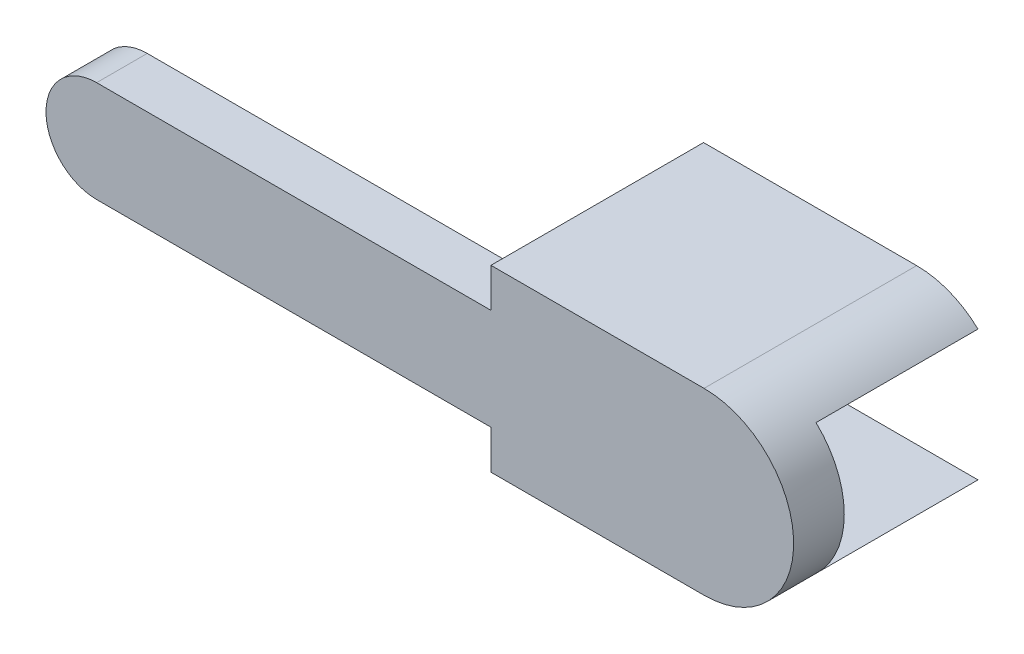
ISO-10303-21;
HEADER;
FILE_DESCRIPTION(('STEP AP214'),'2;1');
FILE_NAME('part.step','',(''),(''),'','','');
FILE_SCHEMA(('AUTOMOTIVE_DESIGN { 1 0 10303 214 1 1 1 1 }'));
ENDSEC;
DATA;
#1=APPLICATION_CONTEXT('core data for automotive mechanical design processes');
#2=APPLICATION_PROTOCOL_DEFINITION('international standard','automotive_design',2000,#1);
#3=PRODUCT_CONTEXT('',#1,'mechanical');
#4=PRODUCT('Part','Part','',(#3));
#5=PRODUCT_RELATED_PRODUCT_CATEGORY('part','',(#4));
#6=PRODUCT_DEFINITION_FORMATION('','',#4);
#7=PRODUCT_DEFINITION_CONTEXT('part definition',#1,'design');
#8=PRODUCT_DEFINITION('design','',#6,#7);
#9=PRODUCT_DEFINITION_SHAPE('','',#8);
#10=(LENGTH_UNIT() NAMED_UNIT(*) SI_UNIT(.MILLI.,.METRE.));
#11=(NAMED_UNIT(*) PLANE_ANGLE_UNIT() SI_UNIT($,.RADIAN.));
#12=(NAMED_UNIT(*) SI_UNIT($,.STERADIAN.) SOLID_ANGLE_UNIT());
#13=UNCERTAINTY_MEASURE_WITH_UNIT(LENGTH_MEASURE(1.E-05),#10,'distance_accuracy_value','');
#14=(GEOMETRIC_REPRESENTATION_CONTEXT(3) GLOBAL_UNCERTAINTY_ASSIGNED_CONTEXT((#13)) GLOBAL_UNIT_ASSIGNED_CONTEXT((#10,
#11,#12)) REPRESENTATION_CONTEXT('',''));
#15=CARTESIAN_POINT('',(0.,0.,0.));
#16=DIRECTION('',(0.,0.,1.));
#17=DIRECTION('',(1.,0.,0.));
#18=AXIS2_PLACEMENT_3D('',#15,#16,#17);
#19=CARTESIAN_POINT('',(60.,0.,0.));
#20=DIRECTION('',(0.,0.,1.));
#21=DIRECTION('',(1.,0.,0.));
#22=AXIS2_PLACEMENT_3D('',#19,#20,#21);
#23=PLANE('',#22);
#24=CARTESIAN_POINT('',(0.,0.,0.));
#25=DIRECTION('',(0.,0.,-1.));
#26=DIRECTION('',(-1.,0.,0.));
#27=AXIS2_PLACEMENT_3D('',#24,#25,#26);
#28=CIRCLE('',#27,2.35);
#29=CARTESIAN_POINT('',(-2.35,0.,0.));
#30=VERTEX_POINT('',#29);
#31=EDGE_CURVE('E196',#30,#30,#28,.T.);
#32=ORIENTED_EDGE('',*,*,#31,.F.);
#33=EDGE_LOOP('',(#32));
#34=FACE_BOUND('',#33,.T.);
#35=DIRECTION('',(0.,1.,0.));
#36=VECTOR('',#35,1.);
#37=CARTESIAN_POINT('',(38.95,8.85,0.));
#38=LINE('',#37,#36);
#39=CARTESIAN_POINT('',(38.95,-5.,0.));
#40=VERTEX_POINT('',#39);
#41=CARTESIAN_POINT('',(38.95,5.,0.));
#42=VERTEX_POINT('',#41);
#43=EDGE_CURVE('E11',#40,#42,#38,.T.);
#44=ORIENTED_EDGE('',*,*,#43,.F.);
#45=DIRECTION('',(1.,0.,0.));
#46=VECTOR('',#45,1.);
#47=CARTESIAN_POINT('',(0.,-5.,0.));
#48=LINE('',#47,#46);
#49=CARTESIAN_POINT('',(0.,-5.,0.));
#50=VERTEX_POINT('',#49);
#51=EDGE_CURVE('E213',#50,#40,#48,.T.);
#52=ORIENTED_EDGE('',*,*,#51,.F.);
#53=CARTESIAN_POINT('',(0.,0.,0.));
#54=DIRECTION('',(0.,0.,1.));
#55=DIRECTION('',(1.,0.,0.));
#56=AXIS2_PLACEMENT_3D('',#53,#54,#55);
#57=CIRCLE('',#56,5.);
#58=CARTESIAN_POINT('',(0.,5.,0.));
#59=VERTEX_POINT('',#58);
#60=EDGE_CURVE('E206',#59,#50,#57,.T.);
#61=ORIENTED_EDGE('',*,*,#60,.F.);
#62=DIRECTION('',(1.,0.,0.));
#63=VECTOR('',#62,1.);
#64=CARTESIAN_POINT('',(0.,5.,0.));
#65=LINE('',#64,#63);
#66=EDGE_CURVE('E200',#59,#42,#65,.T.);
#67=ORIENTED_EDGE('',*,*,#66,.T.);
#68=EDGE_LOOP('',(#44,#52,#61,#67));
#69=FACE_BOUND('',#68,.T.);
#70=ADVANCED_FACE('F41',(#34,#69),#23,.F.);
#71=DIRECTION('',(1.,0.,0.));
#72=VECTOR('',#71,1.);
#73=CARTESIAN_POINT('',(66.0597029630172,-6.45,0.));
#74=LINE('',#73,#72);
#75=CARTESIAN_POINT('',(43.45,-6.45,0.));
#76=VERTEX_POINT('',#75);
#77=CARTESIAN_POINT('',(66.0597029630172,-6.45,0.));
#78=VERTEX_POINT('',#77);
#79=EDGE_CURVE('E58',#76,#78,#74,.T.);
#80=ORIENTED_EDGE('',*,*,#79,.F.);
#81=DIRECTION('',(0.,-1.,0.));
#82=VECTOR('',#81,1.);
#83=CARTESIAN_POINT('',(43.45,-6.45,0.));
#84=LINE('',#83,#82);
#85=CARTESIAN_POINT('',(43.45,6.45,0.));
#86=VERTEX_POINT('',#85);
#87=EDGE_CURVE('E129',#86,#76,#84,.T.);
#88=ORIENTED_EDGE('',*,*,#87,.F.);
#89=DIRECTION('',(-1.,0.,0.));
#90=VECTOR('',#89,1.);
#91=CARTESIAN_POINT('',(43.45,6.45,0.));
#92=LINE('',#91,#90);
#93=CARTESIAN_POINT('',(66.0597029630172,6.45,0.));
#94=VERTEX_POINT('',#93);
#95=EDGE_CURVE('E63',#94,#86,#92,.T.);
#96=ORIENTED_EDGE('',*,*,#95,.F.);
#97=CARTESIAN_POINT('',(60.,0.,0.));
#98=DIRECTION('',(0.,0.,1.));
#99=DIRECTION('',(1.,0.,0.));
#100=AXIS2_PLACEMENT_3D('',#97,#98,#99);
#101=CIRCLE('',#100,8.85);
#102=EDGE_CURVE('E167',#78,#94,#101,.T.);
#103=ORIENTED_EDGE('',*,*,#102,.F.);
#104=EDGE_LOOP('',(#80,#88,#96,#103));
#105=FACE_BOUND('',#104,.T.);
#106=ADVANCED_FACE('F131',(#105),#23,.F.);
#107=CARTESIAN_POINT('',(0.,5.,5.));
#108=DIRECTION('',(0.,1.,0.));
#109=DIRECTION('',(0.,0.,1.));
#110=AXIS2_PLACEMENT_3D('',#107,#108,#109);
#111=PLANE('',#110);
#112=DIRECTION('',(1.,0.,0.));
#113=VECTOR('',#112,1.);
#114=CARTESIAN_POINT('',(0.,5.,5.));
#115=LINE('',#114,#113);
#116=CARTESIAN_POINT('',(0.,5.,5.));
#117=VERTEX_POINT('',#116);
#118=CARTESIAN_POINT('',(38.95,5.,5.));
#119=VERTEX_POINT('',#118);
#120=EDGE_CURVE('E203',#117,#119,#115,.T.);
#121=ORIENTED_EDGE('',*,*,#120,.T.);
#122=DIRECTION('',(0.,0.,-1.));
#123=VECTOR('',#122,1.);
#124=CARTESIAN_POINT('',(38.95,5.,5.));
#125=LINE('',#124,#123);
#126=EDGE_CURVE('E194',#119,#42,#125,.T.);
#127=ORIENTED_EDGE('',*,*,#126,.T.);
#128=ORIENTED_EDGE('',*,*,#66,.F.);
#129=DIRECTION('',(0.,0.,-1.));
#130=VECTOR('',#129,1.);
#131=CARTESIAN_POINT('',(0.,5.,5.));
#132=LINE('',#131,#130);
#133=EDGE_CURVE('E50',#117,#59,#132,.T.);
#134=ORIENTED_EDGE('',*,*,#133,.F.);
#135=EDGE_LOOP('',(#121,#127,#128,#134));
#136=FACE_BOUND('',#135,.T.);
#137=ADVANCED_FACE('F43',(#136),#111,.T.);
#138=CARTESIAN_POINT('',(0.,-5.,5.));
#139=DIRECTION('',(0.,1.,0.));
#140=DIRECTION('',(0.,0.,1.));
#141=AXIS2_PLACEMENT_3D('',#138,#139,#140);
#142=PLANE('',#141);
#143=DIRECTION('',(0.,0.,-1.));
#144=VECTOR('',#143,1.);
#145=CARTESIAN_POINT('',(38.95,-5.,5.));
#146=LINE('',#145,#144);
#147=CARTESIAN_POINT('',(38.95,-5.,5.));
#148=VERTEX_POINT('',#147);
#149=EDGE_CURVE('E169',#148,#40,#146,.T.);
#150=ORIENTED_EDGE('',*,*,#149,.F.);
#151=DIRECTION('',(1.,0.,0.));
#152=VECTOR('',#151,1.);
#153=CARTESIAN_POINT('',(0.,-5.,5.));
#154=LINE('',#153,#152);
#155=CARTESIAN_POINT('',(0.,-5.,5.));
#156=VERTEX_POINT('',#155);
#157=EDGE_CURVE('E205',#156,#148,#154,.T.);
#158=ORIENTED_EDGE('',*,*,#157,.F.);
#159=DIRECTION('',(0.,0.,-1.));
#160=VECTOR('',#159,1.);
#161=CARTESIAN_POINT('',(0.,-5.,5.));
#162=LINE('',#161,#160);
#163=EDGE_CURVE('E45',#156,#50,#162,.T.);
#164=ORIENTED_EDGE('',*,*,#163,.T.);
#165=ORIENTED_EDGE('',*,*,#51,.T.);
#166=EDGE_LOOP('',(#150,#158,#164,#165));
#167=FACE_BOUND('',#166,.T.);
#168=ADVANCED_FACE('F224',(#167),#142,.F.);
#169=CARTESIAN_POINT('',(0.,0.,5.));
#170=DIRECTION('',(0.,0.,-1.));
#171=DIRECTION('',(-1.,0.,0.));
#172=AXIS2_PLACEMENT_3D('',#169,#170,#171);
#173=CYLINDRICAL_SURFACE('',#172,5.);
#174=ORIENTED_EDGE('',*,*,#60,.T.);
#175=ORIENTED_EDGE('',*,*,#163,.F.);
#176=CARTESIAN_POINT('',(0.,0.,5.));
#177=DIRECTION('',(0.,0.,1.));
#178=DIRECTION('',(1.,0.,0.));
#179=AXIS2_PLACEMENT_3D('',#176,#177,#178);
#180=CIRCLE('',#179,5.);
#181=EDGE_CURVE('E209',#117,#156,#180,.T.);
#182=ORIENTED_EDGE('',*,*,#181,.F.);
#183=ORIENTED_EDGE('',*,*,#133,.T.);
#184=EDGE_LOOP('',(#174,#175,#182,#183));
#185=FACE_BOUND('',#184,.T.);
#186=ADVANCED_FACE('F236',(#185),#173,.T.);
#187=CARTESIAN_POINT('',(60.,0.,5.));
#188=DIRECTION('',(0.,0.,1.));
#189=DIRECTION('',(1.,0.,0.));
#190=AXIS2_PLACEMENT_3D('',#187,#188,#189);
#191=PLANE('',#190);
#192=DIRECTION('',(0.,1.,0.));
#193=VECTOR('',#192,1.);
#194=CARTESIAN_POINT('',(38.95,-6.35,5.));
#195=LINE('',#194,#193);
#196=CARTESIAN_POINT('',(38.95,8.85,5.));
#197=VERTEX_POINT('',#196);
#198=EDGE_CURVE('E180',#119,#197,#195,.T.);
#199=ORIENTED_EDGE('',*,*,#198,.F.);
#200=ORIENTED_EDGE('',*,*,#120,.F.);
#201=ORIENTED_EDGE('',*,*,#181,.T.);
#202=ORIENTED_EDGE('',*,*,#157,.T.);
#203=CARTESIAN_POINT('',(38.95,-8.85,5.));
#204=VERTEX_POINT('',#203);
#205=EDGE_CURVE('E181',#204,#148,#195,.T.);
#206=ORIENTED_EDGE('',*,*,#205,.F.);
#207=DIRECTION('',(1.,0.,0.));
#208=VECTOR('',#207,1.);
#209=CARTESIAN_POINT('',(38.95,-8.85,5.));
#210=LINE('',#209,#208);
#211=CARTESIAN_POINT('',(60.,-8.85,5.));
#212=VERTEX_POINT('',#211);
#213=EDGE_CURVE('E177',#204,#212,#210,.T.);
#214=ORIENTED_EDGE('',*,*,#213,.T.);
#215=CARTESIAN_POINT('',(60.,0.,5.));
#216=DIRECTION('',(0.,0.,-1.));
#217=DIRECTION('',(-1.,0.,0.));
#218=AXIS2_PLACEMENT_3D('',#215,#216,#217);
#219=CIRCLE('',#218,8.85);
#220=CARTESIAN_POINT('',(60.,8.85,5.));
#221=VERTEX_POINT('',#220);
#222=EDGE_CURVE('E174',#221,#212,#219,.T.);
#223=ORIENTED_EDGE('',*,*,#222,.F.);
#224=DIRECTION('',(1.,0.,0.));
#225=VECTOR('',#224,1.);
#226=CARTESIAN_POINT('',(38.95,8.85,5.));
#227=LINE('',#226,#225);
#228=EDGE_CURVE('E171',#197,#221,#227,.T.);
#229=ORIENTED_EDGE('',*,*,#228,.F.);
#230=EDGE_LOOP('',(#199,#200,#201,#202,#206,#214,#223,#229));
#231=FACE_BOUND('',#230,.T.);
#232=ADVANCED_FACE('F233',(#231),#191,.T.);
#233=CARTESIAN_POINT('',(0.,0.,3.));
#234=DIRECTION('',(0.,0.,-1.));
#235=DIRECTION('',(-1.,0.,0.));
#236=AXIS2_PLACEMENT_3D('',#233,#234,#235);
#237=CYLINDRICAL_SURFACE('',#236,2.35);
#238=CARTESIAN_POINT('',(0.,0.,3.));
#239=DIRECTION('',(0.,0.,-1.));
#240=DIRECTION('',(-1.,0.,0.));
#241=AXIS2_PLACEMENT_3D('',#238,#239,#240);
#242=CIRCLE('',#241,2.35);
#243=CARTESIAN_POINT('',(-2.35,0.,3.));
#244=VERTEX_POINT('',#243);
#245=EDGE_CURVE('E197',#244,#244,#242,.T.);
#246=ORIENTED_EDGE('',*,*,#245,.F.);
#247=EDGE_LOOP('',(#246));
#248=FACE_BOUND('',#247,.T.);
#249=ORIENTED_EDGE('',*,*,#31,.T.);
#250=EDGE_LOOP('',(#249));
#251=FACE_BOUND('',#250,.T.);
#252=ADVANCED_FACE('F243',(#248,#251),#237,.F.);
#253=CARTESIAN_POINT('',(0.,0.,3.));
#254=DIRECTION('',(0.,0.,-1.));
#255=DIRECTION('',(-1.,0.,0.));
#256=AXIS2_PLACEMENT_3D('',#253,#254,#255);
#257=PLANE('',#256);
#258=ORIENTED_EDGE('',*,*,#245,.T.);
#259=EDGE_LOOP('',(#258));
#260=FACE_BOUND('',#259,.T.);
#261=ADVANCED_FACE('F256',(#260),#257,.T.);
#262=CARTESIAN_POINT('',(38.95,-6.35,-34.7462228163005));
#263=DIRECTION('',(1.,0.,0.));
#264=DIRECTION('',(0.,0.,-1.));
#265=AXIS2_PLACEMENT_3D('',#262,#263,#264);
#266=PLANE('',#265);
#267=ORIENTED_EDGE('',*,*,#205,.T.);
#268=ORIENTED_EDGE('',*,*,#149,.T.);
#269=ORIENTED_EDGE('',*,*,#43,.T.);
#270=ORIENTED_EDGE('',*,*,#126,.F.);
#271=ORIENTED_EDGE('',*,*,#198,.T.);
#272=DIRECTION('',(0.,0.,1.));
#273=VECTOR('',#272,1.);
#274=CARTESIAN_POINT('',(38.95,8.85,-34.7462228163005));
#275=LINE('',#274,#273);
#276=CARTESIAN_POINT('',(38.95,8.85,-16.));
#277=VERTEX_POINT('',#276);
#278=EDGE_CURVE('E170',#277,#197,#275,.T.);
#279=ORIENTED_EDGE('',*,*,#278,.F.);
#280=DIRECTION('',(0.,-1.,0.));
#281=VECTOR('',#280,1.);
#282=CARTESIAN_POINT('',(38.95,8.85,-16.));
#283=LINE('',#282,#281);
#284=CARTESIAN_POINT('',(38.95,-8.85,-16.));
#285=VERTEX_POINT('',#284);
#286=EDGE_CURVE('E166',#277,#285,#283,.T.);
#287=ORIENTED_EDGE('',*,*,#286,.T.);
#288=DIRECTION('',(0.,0.,1.));
#289=VECTOR('',#288,1.);
#290=CARTESIAN_POINT('',(38.95,-8.85,-34.7462228163005));
#291=LINE('',#290,#289);
#292=EDGE_CURVE('E184',#285,#204,#291,.T.);
#293=ORIENTED_EDGE('',*,*,#292,.T.);
#294=EDGE_LOOP('',(#267,#268,#269,#270,#271,#279,#287,#293));
#295=FACE_BOUND('',#294,.T.);
#296=ADVANCED_FACE('F229',(#295),#266,.F.);
#297=CARTESIAN_POINT('',(38.95,-8.85,-34.7462228163005));
#298=DIRECTION('',(0.,-1.,0.));
#299=DIRECTION('',(0.,0.,-1.));
#300=AXIS2_PLACEMENT_3D('',#297,#298,#299);
#301=PLANE('',#300);
#302=ORIENTED_EDGE('',*,*,#292,.F.);
#303=DIRECTION('',(1.,0.,0.));
#304=VECTOR('',#303,1.);
#305=CARTESIAN_POINT('',(60.,-8.85,-16.));
#306=LINE('',#305,#304);
#307=CARTESIAN_POINT('',(60.,-8.85,-16.));
#308=VERTEX_POINT('',#307);
#309=EDGE_CURVE('E304',#285,#308,#306,.T.);
#310=ORIENTED_EDGE('',*,*,#309,.T.);
#311=DIRECTION('',(0.,0.,1.));
#312=VECTOR('',#311,1.);
#313=CARTESIAN_POINT('',(60.,-8.85,-34.7462228163005));
#314=LINE('',#313,#312);
#315=EDGE_CURVE('E186',#308,#212,#314,.T.);
#316=ORIENTED_EDGE('',*,*,#315,.T.);
#317=ORIENTED_EDGE('',*,*,#213,.F.);
#318=EDGE_LOOP('',(#302,#310,#316,#317));
#319=FACE_BOUND('',#318,.T.);
#320=ADVANCED_FACE('F269',(#319),#301,.T.);
#321=CARTESIAN_POINT('',(60.,0.,-34.7462228163005));
#322=DIRECTION('',(0.,0.,1.));
#323=DIRECTION('',(1.,0.,0.));
#324=AXIS2_PLACEMENT_3D('',#321,#322,#323);
#325=CYLINDRICAL_SURFACE('',#324,8.85);
#326=ORIENTED_EDGE('',*,*,#315,.F.);
#327=CARTESIAN_POINT('',(60.,0.,-16.));
#328=DIRECTION('',(0.,0.,1.));
#329=DIRECTION('',(0.,-1.,0.));
#330=AXIS2_PLACEMENT_3D('',#327,#328,#329);
#331=CIRCLE('',#330,8.85000000000003);
#332=CARTESIAN_POINT('',(66.0597029630172,-6.45,-16.));
#333=VERTEX_POINT('',#332);
#334=EDGE_CURVE('E307',#308,#333,#331,.T.);
#335=ORIENTED_EDGE('',*,*,#334,.T.);
#336=DIRECTION('',(0.,0.,1.));
#337=VECTOR('',#336,1.);
#338=CARTESIAN_POINT('',(66.0597029630172,-6.45,-48.3763184247843));
#339=LINE('',#338,#337);
#340=EDGE_CURVE('E157',#333,#78,#339,.T.);
#341=ORIENTED_EDGE('',*,*,#340,.T.);
#342=ORIENTED_EDGE('',*,*,#102,.T.);
#343=DIRECTION('',(0.,0.,1.));
#344=VECTOR('',#343,1.);
#345=CARTESIAN_POINT('',(66.0597029630172,6.45,-48.3763184247843));
#346=LINE('',#345,#344);
#347=CARTESIAN_POINT('',(66.0597029630172,6.45,-16.));
#348=VERTEX_POINT('',#347);
#349=EDGE_CURVE('E142',#348,#94,#346,.T.);
#350=ORIENTED_EDGE('',*,*,#349,.F.);
#351=CARTESIAN_POINT('',(60.,0.,-16.));
#352=DIRECTION('',(0.,0.,1.));
#353=DIRECTION('',(0.,-1.,0.));
#354=AXIS2_PLACEMENT_3D('',#351,#352,#353);
#355=CIRCLE('',#354,8.84999999999998);
#356=CARTESIAN_POINT('',(60.,8.85,-16.));
#357=VERTEX_POINT('',#356);
#358=EDGE_CURVE('E154',#348,#357,#355,.T.);
#359=ORIENTED_EDGE('',*,*,#358,.T.);
#360=DIRECTION('',(0.,0.,1.));
#361=VECTOR('',#360,1.);
#362=CARTESIAN_POINT('',(60.,8.85,-34.7462228163005));
#363=LINE('',#362,#361);
#364=EDGE_CURVE('E188',#357,#221,#363,.T.);
#365=ORIENTED_EDGE('',*,*,#364,.T.);
#366=ORIENTED_EDGE('',*,*,#222,.T.);
#367=EDGE_LOOP('',(#326,#335,#341,#342,#350,#359,#365,#366));
#368=FACE_BOUND('',#367,.T.);
#369=ADVANCED_FACE('F265',(#368),#325,.T.);
#370=CARTESIAN_POINT('',(38.95,8.85,-34.7462228163005));
#371=DIRECTION('',(0.,-1.,0.));
#372=DIRECTION('',(0.,0.,-1.));
#373=AXIS2_PLACEMENT_3D('',#370,#371,#372);
#374=PLANE('',#373);
#375=ORIENTED_EDGE('',*,*,#364,.F.);
#376=DIRECTION('',(-1.,0.,0.));
#377=VECTOR('',#376,1.);
#378=CARTESIAN_POINT('',(60.,8.85,-16.));
#379=LINE('',#378,#377);
#380=EDGE_CURVE('E163',#357,#277,#379,.T.);
#381=ORIENTED_EDGE('',*,*,#380,.T.);
#382=ORIENTED_EDGE('',*,*,#278,.T.);
#383=ORIENTED_EDGE('',*,*,#228,.T.);
#384=EDGE_LOOP('',(#375,#381,#382,#383));
#385=FACE_BOUND('',#384,.T.);
#386=ADVANCED_FACE('F261',(#385),#374,.F.);
#387=CARTESIAN_POINT('',(66.0597029630172,-6.45,-48.3763184247843));
#388=DIRECTION('',(0.,-1.,0.));
#389=DIRECTION('',(1.,0.,0.));
#390=AXIS2_PLACEMENT_3D('',#387,#388,#389);
#391=PLANE('',#390);
#392=ORIENTED_EDGE('',*,*,#340,.F.);
#393=DIRECTION('',(-1.,0.,0.));
#394=VECTOR('',#393,1.);
#395=CARTESIAN_POINT('',(66.0597029630172,-6.45,-16.));
#396=LINE('',#395,#394);
#397=CARTESIAN_POINT('',(43.45,-6.45,-16.));
#398=VERTEX_POINT('',#397);
#399=EDGE_CURVE('E310',#333,#398,#396,.T.);
#400=ORIENTED_EDGE('',*,*,#399,.T.);
#401=DIRECTION('',(0.,0.,1.));
#402=VECTOR('',#401,1.);
#403=CARTESIAN_POINT('',(43.45,-6.45,-48.3763184247843));
#404=LINE('',#403,#402);
#405=EDGE_CURVE('E143',#398,#76,#404,.T.);
#406=ORIENTED_EDGE('',*,*,#405,.T.);
#407=ORIENTED_EDGE('',*,*,#79,.T.);
#408=EDGE_LOOP('',(#392,#400,#406,#407));
#409=FACE_BOUND('',#408,.T.);
#410=ADVANCED_FACE('F264',(#409),#391,.F.);
#411=CARTESIAN_POINT('',(43.45,-6.45,-48.3763184247843));
#412=DIRECTION('',(-1.,0.,0.));
#413=DIRECTION('',(0.,0.,1.));
#414=AXIS2_PLACEMENT_3D('',#411,#412,#413);
#415=PLANE('',#414);
#416=ORIENTED_EDGE('',*,*,#405,.F.);
#417=DIRECTION('',(0.,1.,0.));
#418=VECTOR('',#417,1.);
#419=CARTESIAN_POINT('',(43.45,-6.45000000000001,-16.));
#420=LINE('',#419,#418);
#421=CARTESIAN_POINT('',(43.45,6.45,-16.));
#422=VERTEX_POINT('',#421);
#423=EDGE_CURVE('E139',#398,#422,#420,.T.);
#424=ORIENTED_EDGE('',*,*,#423,.T.);
#425=DIRECTION('',(0.,0.,1.));
#426=VECTOR('',#425,1.);
#427=CARTESIAN_POINT('',(43.45,6.45,-48.3763184247843));
#428=LINE('',#427,#426);
#429=EDGE_CURVE('E137',#422,#86,#428,.T.);
#430=ORIENTED_EDGE('',*,*,#429,.T.);
#431=ORIENTED_EDGE('',*,*,#87,.T.);
#432=EDGE_LOOP('',(#416,#424,#430,#431));
#433=FACE_BOUND('',#432,.T.);
#434=ADVANCED_FACE('F138',(#433),#415,.F.);
#435=CARTESIAN_POINT('',(43.45,6.45,-48.3763184247843));
#436=DIRECTION('',(0.,1.,0.));
#437=DIRECTION('',(-1.,0.,0.));
#438=AXIS2_PLACEMENT_3D('',#435,#436,#437);
#439=PLANE('',#438);
#440=ORIENTED_EDGE('',*,*,#429,.F.);
#441=DIRECTION('',(1.,0.,0.));
#442=VECTOR('',#441,1.);
#443=CARTESIAN_POINT('',(43.45,6.45,-16.));
#444=LINE('',#443,#442);
#445=EDGE_CURVE('E313',#422,#348,#444,.T.);
#446=ORIENTED_EDGE('',*,*,#445,.T.);
#447=ORIENTED_EDGE('',*,*,#349,.T.);
#448=ORIENTED_EDGE('',*,*,#95,.T.);
#449=EDGE_LOOP('',(#440,#446,#447,#448));
#450=FACE_BOUND('',#449,.T.);
#451=ADVANCED_FACE('F146',(#450),#439,.F.);
#452=CARTESIAN_POINT('',(54.95,0.,-16.));
#453=DIRECTION('',(0.,0.,1.));
#454=DIRECTION('',(-1.,0.,0.));
#455=AXIS2_PLACEMENT_3D('',#452,#453,#454);
#456=PLANE('',#455);
#457=CARTESIAN_POINT('',(41.25,0.,-16.));
#458=DIRECTION('',(0.,0.,-1.));
#459=DIRECTION('',(0.,1.,0.));
#460=AXIS2_PLACEMENT_3D('',#457,#458,#459);
#461=CIRCLE('',#460,1.025);
#462=CARTESIAN_POINT('',(41.25,1.025,-16.));
#463=VERTEX_POINT('',#462);
#464=EDGE_CURVE('E151',#463,#463,#461,.T.);
#465=ORIENTED_EDGE('',*,*,#464,.F.);
#466=EDGE_LOOP('',(#465));
#467=FACE_BOUND('',#466,.T.);
#468=ORIENTED_EDGE('',*,*,#445,.F.);
#469=ORIENTED_EDGE('',*,*,#423,.F.);
#470=ORIENTED_EDGE('',*,*,#399,.F.);
#471=ORIENTED_EDGE('',*,*,#334,.F.);
#472=ORIENTED_EDGE('',*,*,#309,.F.);
#473=ORIENTED_EDGE('',*,*,#286,.F.);
#474=ORIENTED_EDGE('',*,*,#380,.F.);
#475=ORIENTED_EDGE('',*,*,#358,.F.);
#476=EDGE_LOOP('',(#468,#469,#470,#471,#472,#473,#474,#475));
#477=FACE_BOUND('',#476,.T.);
#478=ADVANCED_FACE('F278',(#467,#477),#456,.F.);
#479=CARTESIAN_POINT('',(41.25,0.,-11.));
#480=DIRECTION('',(0.,0.,-1.));
#481=DIRECTION('',(0.,1.,0.));
#482=AXIS2_PLACEMENT_3D('',#479,#480,#481);
#483=CYLINDRICAL_SURFACE('',#482,1.025);
#484=CARTESIAN_POINT('',(41.25,0.,-11.));
#485=DIRECTION('',(0.,0.,-1.));
#486=DIRECTION('',(0.,1.,0.));
#487=AXIS2_PLACEMENT_3D('',#484,#485,#486);
#488=CIRCLE('',#487,1.025);
#489=CARTESIAN_POINT('',(41.25,1.025,-11.));
#490=VERTEX_POINT('',#489);
#491=EDGE_CURVE('E148',#490,#490,#488,.T.);
#492=ORIENTED_EDGE('',*,*,#491,.F.);
#493=EDGE_LOOP('',(#492));
#494=FACE_BOUND('',#493,.T.);
#495=ORIENTED_EDGE('',*,*,#464,.T.);
#496=EDGE_LOOP('',(#495));
#497=FACE_BOUND('',#496,.T.);
#498=ADVANCED_FACE('F286',(#494,#497),#483,.F.);
#499=CARTESIAN_POINT('',(41.25,0.,-11.));
#500=DIRECTION('',(0.,0.,-1.));
#501=DIRECTION('',(0.,1.,0.));
#502=AXIS2_PLACEMENT_3D('',#499,#500,#501);
#503=PLANE('',#502);
#504=ORIENTED_EDGE('',*,*,#491,.T.);
#505=EDGE_LOOP('',(#504));
#506=FACE_BOUND('',#505,.T.);
#507=ADVANCED_FACE('F290',(#506),#503,.T.);
#508=CLOSED_SHELL('',(#70,#106,#137,#168,#186,#232,#252,#261,#296,#320,#369,#386,#410,#434,#451,
#478,#498,#507));
#509=MANIFOLD_SOLID_BREP('B2',#508);
#510=ADVANCED_BREP_SHAPE_REPRESENTATION('',(#18,#509),#14);
#511=SHAPE_DEFINITION_REPRESENTATION(#9,#510);
ENDSEC;
END-ISO-10303-21;
